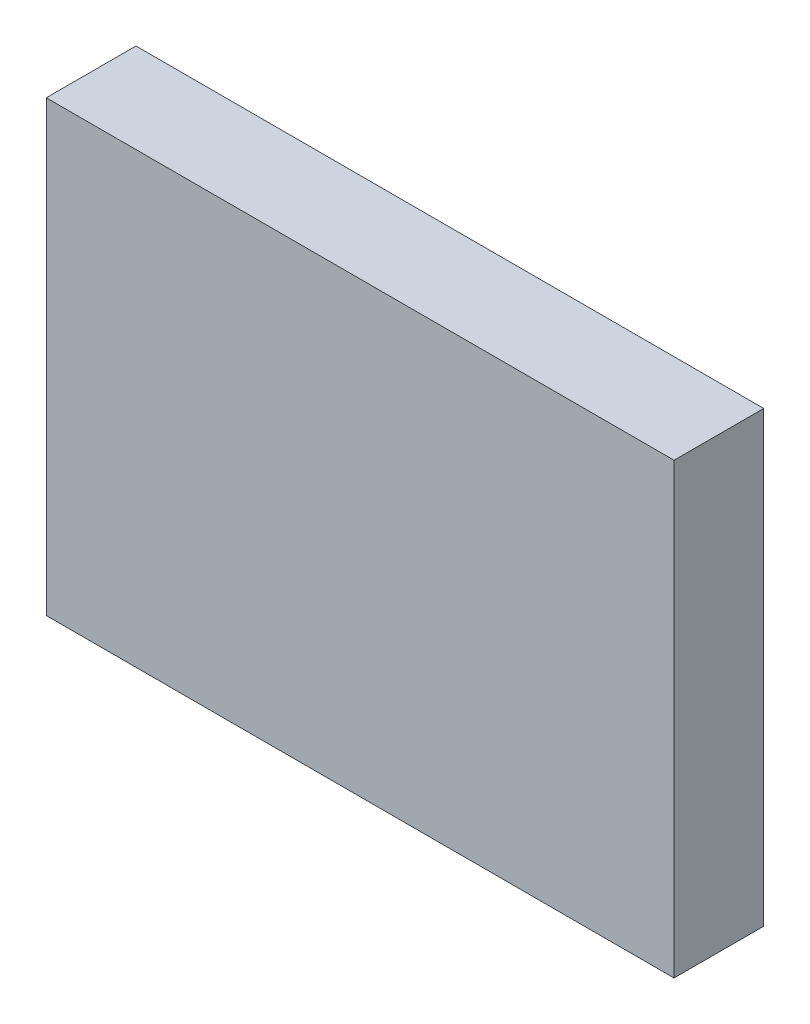
ISO-10303-21;
HEADER;
FILE_DESCRIPTION(('STEP AP214'),'2;1');
FILE_NAME('part.step','',(''),(''),'','','');
FILE_SCHEMA(('AUTOMOTIVE_DESIGN { 1 0 10303 214 1 1 1 1 }'));
ENDSEC;
DATA;
#1=APPLICATION_CONTEXT('core data for automotive mechanical design processes');
#2=APPLICATION_PROTOCOL_DEFINITION('international standard','automotive_design',2000,#1);
#3=PRODUCT_CONTEXT('',#1,'mechanical');
#4=PRODUCT('Part','Part','',(#3));
#5=PRODUCT_RELATED_PRODUCT_CATEGORY('part','',(#4));
#6=PRODUCT_DEFINITION_FORMATION('','',#4);
#7=PRODUCT_DEFINITION_CONTEXT('part definition',#1,'design');
#8=PRODUCT_DEFINITION('design','',#6,#7);
#9=PRODUCT_DEFINITION_SHAPE('','',#8);
#10=(LENGTH_UNIT() NAMED_UNIT(*) SI_UNIT(.MILLI.,.METRE.));
#11=(NAMED_UNIT(*) PLANE_ANGLE_UNIT() SI_UNIT($,.RADIAN.));
#12=(NAMED_UNIT(*) SI_UNIT($,.STERADIAN.) SOLID_ANGLE_UNIT());
#13=UNCERTAINTY_MEASURE_WITH_UNIT(LENGTH_MEASURE(1.E-05),#10,'distance_accuracy_value','');
#14=(GEOMETRIC_REPRESENTATION_CONTEXT(3) GLOBAL_UNCERTAINTY_ASSIGNED_CONTEXT((#13)) GLOBAL_UNIT_ASSIGNED_CONTEXT((#10,
#11,#12)) REPRESENTATION_CONTEXT('',''));
#15=CARTESIAN_POINT('',(0.,0.,0.));
#16=DIRECTION('',(0.,0.,1.));
#17=DIRECTION('',(1.,0.,0.));
#18=AXIS2_PLACEMENT_3D('',#15,#16,#17);
#19=CARTESIAN_POINT('',(28.,20.,4.));
#20=DIRECTION('',(1.,0.,0.));
#21=DIRECTION('',(0.,1.,0.));
#22=AXIS2_PLACEMENT_3D('',#19,#20,#21);
#23=PLANE('',#22);
#24=DIRECTION('',(0.,-1.,0.));
#25=VECTOR('',#24,1.);
#26=CARTESIAN_POINT('',(28.,20.,0.));
#27=LINE('',#26,#25);
#28=CARTESIAN_POINT('',(28.,20.,0.));
#29=VERTEX_POINT('',#28);
#30=CARTESIAN_POINT('',(28.,0.,0.));
#31=VERTEX_POINT('',#30);
#32=EDGE_CURVE('E97',#29,#31,#27,.T.);
#33=ORIENTED_EDGE('',*,*,#32,.F.);
#34=DIRECTION('',(0.,0.,-1.));
#35=VECTOR('',#34,1.);
#36=CARTESIAN_POINT('',(28.,20.,4.));
#37=LINE('',#36,#35);
#38=CARTESIAN_POINT('',(28.,20.,4.));
#39=VERTEX_POINT('',#38);
#40=EDGE_CURVE('E11',#39,#29,#37,.T.);
#41=ORIENTED_EDGE('',*,*,#40,.F.);
#42=DIRECTION('',(0.,-1.,0.));
#43=VECTOR('',#42,1.);
#44=CARTESIAN_POINT('',(28.,20.,4.));
#45=LINE('',#44,#43);
#46=CARTESIAN_POINT('',(28.,0.,4.));
#47=VERTEX_POINT('',#46);
#48=EDGE_CURVE('E91',#39,#47,#45,.T.);
#49=ORIENTED_EDGE('',*,*,#48,.T.);
#50=DIRECTION('',(0.,0.,-1.));
#51=VECTOR('',#50,1.);
#52=CARTESIAN_POINT('',(28.,0.,4.));
#53=LINE('',#52,#51);
#54=EDGE_CURVE('E36',#47,#31,#53,.T.);
#55=ORIENTED_EDGE('',*,*,#54,.T.);
#56=EDGE_LOOP('',(#33,#41,#49,#55));
#57=FACE_BOUND('',#56,.T.);
#58=ADVANCED_FACE('F33',(#57),#23,.T.);
#59=CARTESIAN_POINT('',(0.,20.,4.));
#60=DIRECTION('',(0.,1.,0.));
#61=DIRECTION('',(-1.,0.,0.));
#62=AXIS2_PLACEMENT_3D('',#59,#60,#61);
#63=PLANE('',#62);
#64=DIRECTION('',(1.,0.,0.));
#65=VECTOR('',#64,1.);
#66=CARTESIAN_POINT('',(0.,20.,0.));
#67=LINE('',#66,#65);
#68=CARTESIAN_POINT('',(0.,20.,0.));
#69=VERTEX_POINT('',#68);
#70=EDGE_CURVE('E93',#69,#29,#67,.T.);
#71=ORIENTED_EDGE('',*,*,#70,.F.);
#72=DIRECTION('',(0.,0.,-1.));
#73=VECTOR('',#72,1.);
#74=CARTESIAN_POINT('',(0.,20.,4.));
#75=LINE('',#74,#73);
#76=CARTESIAN_POINT('',(0.,20.,4.));
#77=VERTEX_POINT('',#76);
#78=EDGE_CURVE('E42',#77,#69,#75,.T.);
#79=ORIENTED_EDGE('',*,*,#78,.F.);
#80=DIRECTION('',(1.,0.,0.));
#81=VECTOR('',#80,1.);
#82=CARTESIAN_POINT('',(0.,20.,4.));
#83=LINE('',#82,#81);
#84=EDGE_CURVE('E88',#77,#39,#83,.T.);
#85=ORIENTED_EDGE('',*,*,#84,.T.);
#86=ORIENTED_EDGE('',*,*,#40,.T.);
#87=EDGE_LOOP('',(#71,#79,#85,#86));
#88=FACE_BOUND('',#87,.T.);
#89=ADVANCED_FACE('F107',(#88),#63,.T.);
#90=CARTESIAN_POINT('',(0.,0.,4.));
#91=DIRECTION('',(-1.,0.,0.));
#92=DIRECTION('',(0.,-1.,0.));
#93=AXIS2_PLACEMENT_3D('',#90,#91,#92);
#94=PLANE('',#93);
#95=DIRECTION('',(0.,1.,0.));
#96=VECTOR('',#95,1.);
#97=CARTESIAN_POINT('',(0.,0.,0.));
#98=LINE('',#97,#96);
#99=CARTESIAN_POINT('',(0.,0.,0.));
#100=VERTEX_POINT('',#99);
#101=EDGE_CURVE('E83',#100,#69,#98,.T.);
#102=ORIENTED_EDGE('',*,*,#101,.F.);
#103=DIRECTION('',(0.,0.,-1.));
#104=VECTOR('',#103,1.);
#105=CARTESIAN_POINT('',(0.,0.,4.));
#106=LINE('',#105,#104);
#107=CARTESIAN_POINT('',(0.,0.,4.));
#108=VERTEX_POINT('',#107);
#109=EDGE_CURVE('E78',#108,#100,#106,.T.);
#110=ORIENTED_EDGE('',*,*,#109,.F.);
#111=DIRECTION('',(0.,1.,0.));
#112=VECTOR('',#111,1.);
#113=CARTESIAN_POINT('',(0.,0.,4.));
#114=LINE('',#113,#112);
#115=EDGE_CURVE('E81',#108,#77,#114,.T.);
#116=ORIENTED_EDGE('',*,*,#115,.T.);
#117=ORIENTED_EDGE('',*,*,#78,.T.);
#118=EDGE_LOOP('',(#102,#110,#116,#117));
#119=FACE_BOUND('',#118,.T.);
#120=ADVANCED_FACE('F80',(#119),#94,.T.);
#121=CARTESIAN_POINT('',(28.,0.,4.));
#122=DIRECTION('',(0.,-1.,0.));
#123=DIRECTION('',(1.,0.,0.));
#124=AXIS2_PLACEMENT_3D('',#121,#122,#123);
#125=PLANE('',#124);
#126=DIRECTION('',(-1.,0.,0.));
#127=VECTOR('',#126,1.);
#128=CARTESIAN_POINT('',(28.,0.,0.));
#129=LINE('',#128,#127);
#130=EDGE_CURVE('E100',#31,#100,#129,.T.);
#131=ORIENTED_EDGE('',*,*,#130,.F.);
#132=ORIENTED_EDGE('',*,*,#54,.F.);
#133=DIRECTION('',(-1.,0.,0.));
#134=VECTOR('',#133,1.);
#135=CARTESIAN_POINT('',(28.,0.,4.));
#136=LINE('',#135,#134);
#137=EDGE_CURVE('E87',#47,#108,#136,.T.);
#138=ORIENTED_EDGE('',*,*,#137,.T.);
#139=ORIENTED_EDGE('',*,*,#109,.T.);
#140=EDGE_LOOP('',(#131,#132,#138,#139));
#141=FACE_BOUND('',#140,.T.);
#142=ADVANCED_FACE('F90',(#141),#125,.T.);
#143=CARTESIAN_POINT('',(0.,0.,4.));
#144=DIRECTION('',(0.,0.,-1.));
#145=DIRECTION('',(-1.,0.,0.));
#146=AXIS2_PLACEMENT_3D('',#143,#144,#145);
#147=PLANE('',#146);
#148=ORIENTED_EDGE('',*,*,#48,.F.);
#149=ORIENTED_EDGE('',*,*,#84,.F.);
#150=ORIENTED_EDGE('',*,*,#115,.F.);
#151=ORIENTED_EDGE('',*,*,#137,.F.);
#152=EDGE_LOOP('',(#148,#149,#150,#151));
#153=FACE_BOUND('',#152,.T.);
#154=ADVANCED_FACE('F86',(#153),#147,.F.);
#155=CARTESIAN_POINT('',(0.,0.,0.));
#156=DIRECTION('',(0.,0.,-1.));
#157=DIRECTION('',(-1.,0.,0.));
#158=AXIS2_PLACEMENT_3D('',#155,#156,#157);
#159=PLANE('',#158);
#160=ORIENTED_EDGE('',*,*,#32,.T.);
#161=ORIENTED_EDGE('',*,*,#130,.T.);
#162=ORIENTED_EDGE('',*,*,#101,.T.);
#163=ORIENTED_EDGE('',*,*,#70,.T.);
#164=EDGE_LOOP('',(#160,#161,#162,#163));
#165=FACE_BOUND('',#164,.T.);
#166=ADVANCED_FACE('F106',(#165),#159,.T.);
#167=CLOSED_SHELL('',(#58,#89,#120,#142,#154,#166));
#168=MANIFOLD_SOLID_BREP('B2',#167);
#169=ADVANCED_BREP_SHAPE_REPRESENTATION('',(#18,#168),#14);
#170=SHAPE_DEFINITION_REPRESENTATION(#9,#169);
ENDSEC;
END-ISO-10303-21;
